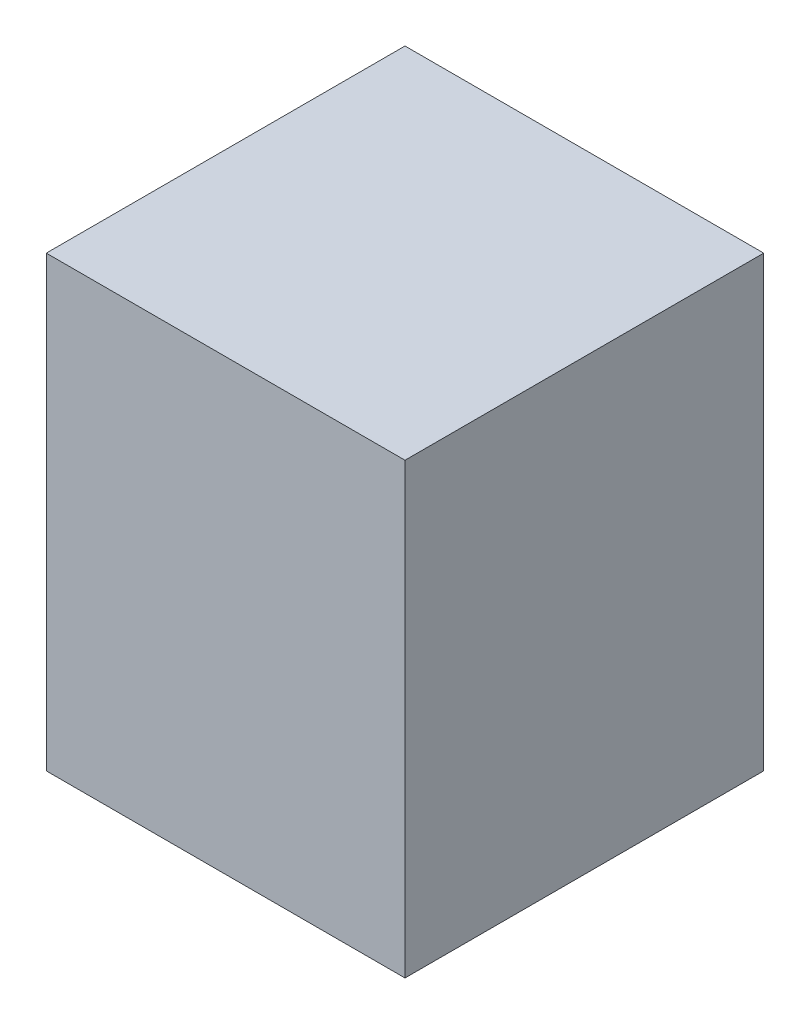
ISO-10303-21;
HEADER;
FILE_DESCRIPTION(('STEP AP214'),'2;1');
FILE_NAME('part.step','',(''),(''),'','','');
FILE_SCHEMA(('AUTOMOTIVE_DESIGN { 1 0 10303 214 1 1 1 1 }'));
ENDSEC;
DATA;
#1=APPLICATION_CONTEXT('core data for automotive mechanical design processes');
#2=APPLICATION_PROTOCOL_DEFINITION('international standard','automotive_design',2000,#1);
#3=PRODUCT_CONTEXT('',#1,'mechanical');
#4=PRODUCT('Part','Part','',(#3));
#5=PRODUCT_RELATED_PRODUCT_CATEGORY('part','',(#4));
#6=PRODUCT_DEFINITION_FORMATION('','',#4);
#7=PRODUCT_DEFINITION_CONTEXT('part definition',#1,'design');
#8=PRODUCT_DEFINITION('design','',#6,#7);
#9=PRODUCT_DEFINITION_SHAPE('','',#8);
#10=(LENGTH_UNIT() NAMED_UNIT(*) SI_UNIT(.MILLI.,.METRE.));
#11=(NAMED_UNIT(*) PLANE_ANGLE_UNIT() SI_UNIT($,.RADIAN.));
#12=(NAMED_UNIT(*) SI_UNIT($,.STERADIAN.) SOLID_ANGLE_UNIT());
#13=UNCERTAINTY_MEASURE_WITH_UNIT(LENGTH_MEASURE(1.E-05),#10,'distance_accuracy_value','');
#14=(GEOMETRIC_REPRESENTATION_CONTEXT(3) GLOBAL_UNCERTAINTY_ASSIGNED_CONTEXT((#13)) GLOBAL_UNIT_ASSIGNED_CONTEXT((#10,
#11,#12)) REPRESENTATION_CONTEXT('',''));
#15=CARTESIAN_POINT('',(0.,0.,0.));
#16=DIRECTION('',(0.,0.,1.));
#17=DIRECTION('',(1.,0.,0.));
#18=AXIS2_PLACEMENT_3D('',#15,#16,#17);
#19=CARTESIAN_POINT('',(0.,15.875,0.));
#20=DIRECTION('',(1.,0.,0.));
#21=DIRECTION('',(0.,0.,-1.));
#22=AXIS2_PLACEMENT_3D('',#19,#20,#21);
#23=PLANE('',#22);
#24=DIRECTION('',(0.,0.,1.));
#25=VECTOR('',#24,1.);
#26=CARTESIAN_POINT('',(0.,0.,0.));
#27=LINE('',#26,#25);
#28=CARTESIAN_POINT('',(0.,0.,-12.7));
#29=VERTEX_POINT('',#28);
#30=CARTESIAN_POINT('',(0.,0.,0.));
#31=VERTEX_POINT('',#30);
#32=EDGE_CURVE('E96',#29,#31,#27,.T.);
#33=ORIENTED_EDGE('',*,*,#32,.T.);
#34=DIRECTION('',(0.,-1.,0.));
#35=VECTOR('',#34,1.);
#36=CARTESIAN_POINT('',(0.,15.875,0.));
#37=LINE('',#36,#35);
#38=CARTESIAN_POINT('',(0.,15.875,0.));
#39=VERTEX_POINT('',#38);
#40=EDGE_CURVE('E11',#39,#31,#37,.T.);
#41=ORIENTED_EDGE('',*,*,#40,.F.);
#42=DIRECTION('',(0.,0.,1.));
#43=VECTOR('',#42,1.);
#44=CARTESIAN_POINT('',(0.,15.875,0.));
#45=LINE('',#44,#43);
#46=CARTESIAN_POINT('',(0.,15.875,-12.7));
#47=VERTEX_POINT('',#46);
#48=EDGE_CURVE('E84',#47,#39,#45,.T.);
#49=ORIENTED_EDGE('',*,*,#48,.F.);
#50=DIRECTION('',(0.,-1.,0.));
#51=VECTOR('',#50,1.);
#52=CARTESIAN_POINT('',(0.,15.875,-12.7));
#53=LINE('',#52,#51);
#54=EDGE_CURVE('E92',#47,#29,#53,.T.);
#55=ORIENTED_EDGE('',*,*,#54,.T.);
#56=EDGE_LOOP('',(#33,#41,#49,#55));
#57=FACE_BOUND('',#56,.T.);
#58=ADVANCED_FACE('F33',(#57),#23,.F.);
#59=CARTESIAN_POINT('',(0.,15.875,0.));
#60=DIRECTION('',(0.,0.,-1.));
#61=DIRECTION('',(-1.,0.,0.));
#62=AXIS2_PLACEMENT_3D('',#59,#60,#61);
#63=PLANE('',#62);
#64=DIRECTION('',(1.,0.,0.));
#65=VECTOR('',#64,1.);
#66=CARTESIAN_POINT('',(0.,0.,0.));
#67=LINE('',#66,#65);
#68=CARTESIAN_POINT('',(12.7,0.,0.));
#69=VERTEX_POINT('',#68);
#70=EDGE_CURVE('E88',#31,#69,#67,.T.);
#71=ORIENTED_EDGE('',*,*,#70,.T.);
#72=DIRECTION('',(0.,-1.,0.));
#73=VECTOR('',#72,1.);
#74=CARTESIAN_POINT('',(12.7,15.875,0.));
#75=LINE('',#74,#73);
#76=CARTESIAN_POINT('',(12.7,15.875,0.));
#77=VERTEX_POINT('',#76);
#78=EDGE_CURVE('E41',#77,#69,#75,.T.);
#79=ORIENTED_EDGE('',*,*,#78,.F.);
#80=DIRECTION('',(1.,0.,0.));
#81=VECTOR('',#80,1.);
#82=CARTESIAN_POINT('',(0.,15.875,0.));
#83=LINE('',#82,#81);
#84=EDGE_CURVE('E79',#39,#77,#83,.T.);
#85=ORIENTED_EDGE('',*,*,#84,.F.);
#86=ORIENTED_EDGE('',*,*,#40,.T.);
#87=EDGE_LOOP('',(#71,#79,#85,#86));
#88=FACE_BOUND('',#87,.T.);
#89=ADVANCED_FACE('F87',(#88),#63,.F.);
#90=CARTESIAN_POINT('',(12.7,15.875,0.));
#91=DIRECTION('',(-1.,0.,0.));
#92=DIRECTION('',(0.,0.,1.));
#93=AXIS2_PLACEMENT_3D('',#90,#91,#92);
#94=PLANE('',#93);
#95=DIRECTION('',(0.,0.,-1.));
#96=VECTOR('',#95,1.);
#97=CARTESIAN_POINT('',(12.7,0.,0.));
#98=LINE('',#97,#96);
#99=CARTESIAN_POINT('',(12.7,0.,-12.7));
#100=VERTEX_POINT('',#99);
#101=EDGE_CURVE('E66',#69,#100,#98,.T.);
#102=ORIENTED_EDGE('',*,*,#101,.T.);
#103=DIRECTION('',(0.,-1.,0.));
#104=VECTOR('',#103,1.);
#105=CARTESIAN_POINT('',(12.7,15.875,-12.7));
#106=LINE('',#105,#104);
#107=CARTESIAN_POINT('',(12.7,15.875,-12.7));
#108=VERTEX_POINT('',#107);
#109=EDGE_CURVE('E89',#108,#100,#106,.T.);
#110=ORIENTED_EDGE('',*,*,#109,.F.);
#111=DIRECTION('',(0.,0.,-1.));
#112=VECTOR('',#111,1.);
#113=CARTESIAN_POINT('',(12.7,15.875,0.));
#114=LINE('',#113,#112);
#115=EDGE_CURVE('E82',#77,#108,#114,.T.);
#116=ORIENTED_EDGE('',*,*,#115,.F.);
#117=ORIENTED_EDGE('',*,*,#78,.T.);
#118=EDGE_LOOP('',(#102,#110,#116,#117));
#119=FACE_BOUND('',#118,.T.);
#120=ADVANCED_FACE('F90',(#119),#94,.F.);
#121=CARTESIAN_POINT('',(0.,15.875,-12.7));
#122=DIRECTION('',(0.,0.,1.));
#123=DIRECTION('',(1.,0.,0.));
#124=AXIS2_PLACEMENT_3D('',#121,#122,#123);
#125=PLANE('',#124);
#126=DIRECTION('',(-1.,0.,0.));
#127=VECTOR('',#126,1.);
#128=CARTESIAN_POINT('',(0.,0.,-12.7));
#129=LINE('',#128,#127);
#130=EDGE_CURVE('E72',#100,#29,#129,.T.);
#131=ORIENTED_EDGE('',*,*,#130,.T.);
#132=ORIENTED_EDGE('',*,*,#54,.F.);
#133=DIRECTION('',(-1.,0.,0.));
#134=VECTOR('',#133,1.);
#135=CARTESIAN_POINT('',(0.,15.875,-12.7));
#136=LINE('',#135,#134);
#137=EDGE_CURVE('E49',#108,#47,#136,.T.);
#138=ORIENTED_EDGE('',*,*,#137,.F.);
#139=ORIENTED_EDGE('',*,*,#109,.T.);
#140=EDGE_LOOP('',(#131,#132,#138,#139));
#141=FACE_BOUND('',#140,.T.);
#142=ADVANCED_FACE('F103',(#141),#125,.F.);
#143=CARTESIAN_POINT('',(0.,15.875,0.));
#144=DIRECTION('',(0.,-1.,0.));
#145=DIRECTION('',(0.,0.,-1.));
#146=AXIS2_PLACEMENT_3D('',#143,#144,#145);
#147=PLANE('',#146);
#148=ORIENTED_EDGE('',*,*,#48,.T.);
#149=ORIENTED_EDGE('',*,*,#84,.T.);
#150=ORIENTED_EDGE('',*,*,#115,.T.);
#151=ORIENTED_EDGE('',*,*,#137,.T.);
#152=EDGE_LOOP('',(#148,#149,#150,#151));
#153=FACE_BOUND('',#152,.T.);
#154=ADVANCED_FACE('F80',(#153),#147,.F.);
#155=CARTESIAN_POINT('',(0.,0.,0.));
#156=DIRECTION('',(0.,-1.,0.));
#157=DIRECTION('',(0.,0.,-1.));
#158=AXIS2_PLACEMENT_3D('',#155,#156,#157);
#159=PLANE('',#158);
#160=ORIENTED_EDGE('',*,*,#32,.F.);
#161=ORIENTED_EDGE('',*,*,#130,.F.);
#162=ORIENTED_EDGE('',*,*,#101,.F.);
#163=ORIENTED_EDGE('',*,*,#70,.F.);
#164=EDGE_LOOP('',(#160,#161,#162,#163));
#165=FACE_BOUND('',#164,.T.);
#166=ADVANCED_FACE('F106',(#165),#159,.T.);
#167=CLOSED_SHELL('',(#58,#89,#120,#142,#154,#166));
#168=MANIFOLD_SOLID_BREP('B2',#167);
#169=ADVANCED_BREP_SHAPE_REPRESENTATION('',(#18,#168),#14);
#170=SHAPE_DEFINITION_REPRESENTATION(#9,#169);
ENDSEC;
END-ISO-10303-21;
